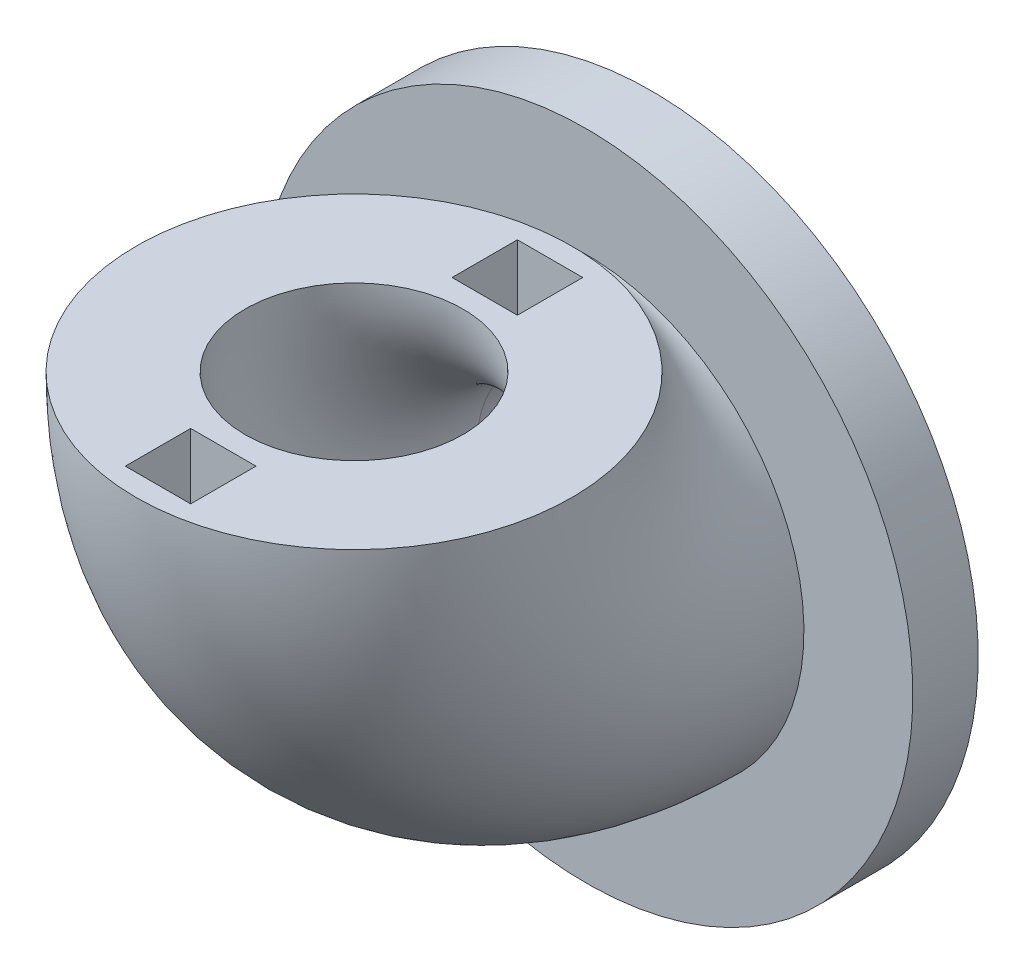
ISO-10303-21;
HEADER;
FILE_DESCRIPTION(('STEP AP214'),'2;1');
FILE_NAME('part.step','',(''),(''),'','','');
FILE_SCHEMA(('AUTOMOTIVE_DESIGN { 1 0 10303 214 1 1 1 1 }'));
ENDSEC;
DATA;
#1=APPLICATION_CONTEXT('core data for automotive mechanical design processes');
#2=APPLICATION_PROTOCOL_DEFINITION('international standard','automotive_design',2000,#1);
#3=PRODUCT_CONTEXT('',#1,'mechanical');
#4=PRODUCT('Part','Part','',(#3));
#5=PRODUCT_RELATED_PRODUCT_CATEGORY('part','',(#4));
#6=PRODUCT_DEFINITION_FORMATION('','',#4);
#7=PRODUCT_DEFINITION_CONTEXT('part definition',#1,'design');
#8=PRODUCT_DEFINITION('design','',#6,#7);
#9=PRODUCT_DEFINITION_SHAPE('','',#8);
#10=(LENGTH_UNIT() NAMED_UNIT(*) SI_UNIT(.MILLI.,.METRE.));
#11=(NAMED_UNIT(*) PLANE_ANGLE_UNIT() SI_UNIT($,.RADIAN.));
#12=(NAMED_UNIT(*) SI_UNIT($,.STERADIAN.) SOLID_ANGLE_UNIT());
#13=UNCERTAINTY_MEASURE_WITH_UNIT(LENGTH_MEASURE(1.E-05),#10,'distance_accuracy_value','');
#14=(GEOMETRIC_REPRESENTATION_CONTEXT(3) GLOBAL_UNCERTAINTY_ASSIGNED_CONTEXT((#13)) GLOBAL_UNIT_ASSIGNED_CONTEXT((#10,
#11,#12)) REPRESENTATION_CONTEXT('',''));
#15=CARTESIAN_POINT('',(0.,0.,0.));
#16=DIRECTION('',(0.,0.,1.));
#17=DIRECTION('',(1.,0.,0.));
#18=AXIS2_PLACEMENT_3D('',#15,#16,#17);
#19=CARTESIAN_POINT('',(0.,10.6543954886718,0.));
#20=DIRECTION('',(-1.,0.,0.));
#21=DIRECTION('',(0.,0.,1.));
#22=AXIS2_PLACEMENT_3D('',#19,#20,#21);
#23=TOROIDAL_SURFACE('',#22,10.6543954886718,10.);
#24=CARTESIAN_POINT('',(0.,0.,0.));
#25=DIRECTION('',(0.,0.,1.));
#26=DIRECTION('',(1.,0.,0.));
#27=AXIS2_PLACEMENT_3D('',#24,#25,#26);
#28=CIRCLE('',#27,10.);
#29=CARTESIAN_POINT('',(0.,-10.,0.));
#30=VERTEX_POINT('',#29);
#31=EDGE_CURVE('E42',#30,#30,#28,.T.);
#32=CARTESIAN_POINT('',(0.,10.6543954886718,10.6543954886718));
#33=DIRECTION('',(0.,1.,0.));
#34=DIRECTION('',(1.,0.,0.));
#35=AXIS2_PLACEMENT_3D('',#32,#33,#34);
#36=CIRCLE('',#35,10.);
#37=CARTESIAN_POINT('',(0.,10.6543954886718,20.6543954886718));
#38=VERTEX_POINT('',#37);
#39=EDGE_CURVE('E48',#38,#38,#36,.T.);
#40=CARTESIAN_POINT('',(0.,10.6543954886718,0.));
#41=DIRECTION('',(-1.,0.,0.));
#42=DIRECTION('',(0.,0.,1.));
#43=AXIS2_PLACEMENT_3D('',#40,#41,#42);
#44=CIRCLE('',#43,20.6543954886718);
#45=EDGE_CURVE('',#30,#38,#44,.T.);
#46=ORIENTED_EDGE('',*,*,#31,.T.);
#47=ORIENTED_EDGE('',*,*,#39,.F.);
#48=ORIENTED_EDGE('',*,*,#45,.T.);
#49=ORIENTED_EDGE('',*,*,#45,.F.);
#50=EDGE_LOOP('',(#46,#48,#47,#49));
#51=FACE_BOUND('',#50,.T.);
#52=ADVANCED_FACE('F39',(#51),#23,.T.);
#53=CARTESIAN_POINT('',(0.,10.6543954886718,10.6543954886718));
#54=DIRECTION('',(0.,1.,0.));
#55=DIRECTION('',(1.,0.,0.));
#56=AXIS2_PLACEMENT_3D('',#53,#54,#55);
#57=PLANE('',#56);
#58=DIRECTION('',(0.,0.,-1.));
#59=VECTOR('',#58,1.);
#60=CARTESIAN_POINT('',(1.5,10.6543954886718,1.65439548867175));
#61=LINE('',#60,#59);
#62=CARTESIAN_POINT('',(1.5,10.6543954886718,4.65439548867175));
#63=VERTEX_POINT('',#62);
#64=CARTESIAN_POINT('',(1.5,10.6543954886718,1.65439548867175));
#65=VERTEX_POINT('',#64);
#66=EDGE_CURVE('E56',#63,#65,#61,.T.);
#67=ORIENTED_EDGE('',*,*,#66,.F.);
#68=DIRECTION('',(1.,0.,0.));
#69=VECTOR('',#68,1.);
#70=CARTESIAN_POINT('',(-1.5,10.6543954886718,4.65439548867175));
#71=LINE('',#70,#69);
#72=CARTESIAN_POINT('',(-1.5,10.6543954886718,4.65439548867175));
#73=VERTEX_POINT('',#72);
#74=EDGE_CURVE('E129',#73,#63,#71,.T.);
#75=ORIENTED_EDGE('',*,*,#74,.F.);
#76=DIRECTION('',(0.,0.,1.));
#77=VECTOR('',#76,1.);
#78=CARTESIAN_POINT('',(-1.5,10.6543954886718,1.65439548867175));
#79=LINE('',#78,#77);
#80=CARTESIAN_POINT('',(-1.5,10.6543954886718,1.65439548867175));
#81=VERTEX_POINT('',#80);
#82=EDGE_CURVE('E133',#81,#73,#79,.T.);
#83=ORIENTED_EDGE('',*,*,#82,.F.);
#84=DIRECTION('',(-1.,0.,0.));
#85=VECTOR('',#84,1.);
#86=CARTESIAN_POINT('',(-1.5,10.6543954886718,1.65439548867175));
#87=LINE('',#86,#85);
#88=EDGE_CURVE('E142',#65,#81,#87,.T.);
#89=ORIENTED_EDGE('',*,*,#88,.F.);
#90=EDGE_LOOP('',(#67,#75,#83,#89));
#91=FACE_BOUND('',#90,.T.);
#92=DIRECTION('',(0.,0.,1.));
#93=VECTOR('',#92,1.);
#94=CARTESIAN_POINT('',(-1.5,10.6543954886718,19.6543954886718));
#95=LINE('',#94,#93);
#96=CARTESIAN_POINT('',(-1.5,10.6543954886718,16.6543954886718));
#97=VERTEX_POINT('',#96);
#98=CARTESIAN_POINT('',(-1.5,10.6543954886718,19.6543954886718));
#99=VERTEX_POINT('',#98);
#100=EDGE_CURVE('E64',#97,#99,#95,.T.);
#101=ORIENTED_EDGE('',*,*,#100,.F.);
#102=DIRECTION('',(-1.,0.,0.));
#103=VECTOR('',#102,1.);
#104=CARTESIAN_POINT('',(-1.5,10.6543954886718,16.6543954886718));
#105=LINE('',#104,#103);
#106=CARTESIAN_POINT('',(1.5,10.6543954886718,16.6543954886718));
#107=VERTEX_POINT('',#106);
#108=EDGE_CURVE('E163',#107,#97,#105,.T.);
#109=ORIENTED_EDGE('',*,*,#108,.F.);
#110=DIRECTION('',(0.,0.,-1.));
#111=VECTOR('',#110,1.);
#112=CARTESIAN_POINT('',(1.5,10.6543954886718,19.6543954886718));
#113=LINE('',#112,#111);
#114=CARTESIAN_POINT('',(1.5,10.6543954886718,19.6543954886718));
#115=VERTEX_POINT('',#114);
#116=EDGE_CURVE('E182',#115,#107,#113,.T.);
#117=ORIENTED_EDGE('',*,*,#116,.F.);
#118=DIRECTION('',(1.,0.,0.));
#119=VECTOR('',#118,1.);
#120=CARTESIAN_POINT('',(-1.5,10.6543954886718,19.6543954886718));
#121=LINE('',#120,#119);
#122=EDGE_CURVE('E178',#99,#115,#121,.T.);
#123=ORIENTED_EDGE('',*,*,#122,.F.);
#124=EDGE_LOOP('',(#101,#109,#117,#123));
#125=FACE_BOUND('',#124,.T.);
#126=CARTESIAN_POINT('',(0.,10.6543954886718,10.6543954886718));
#127=DIRECTION('',(0.,1.,0.));
#128=DIRECTION('',(1.,0.,0.));
#129=AXIS2_PLACEMENT_3D('',#126,#127,#128);
#130=CIRCLE('',#129,5.);
#131=CARTESIAN_POINT('',(0.,10.6543954886718,15.6543954886718));
#132=VERTEX_POINT('',#131);
#133=EDGE_CURVE('E11',#132,#132,#130,.F.);
#134=ORIENTED_EDGE('',*,*,#133,.T.);
#135=EDGE_LOOP('',(#134));
#136=FACE_BOUND('',#135,.T.);
#137=ORIENTED_EDGE('',*,*,#39,.T.);
#138=EDGE_LOOP('',(#137));
#139=FACE_BOUND('',#138,.T.);
#140=ADVANCED_FACE('F244',(#91,#125,#136,#139),#57,.T.);
#141=CARTESIAN_POINT('',(0.,10.6543954886718,0.));
#142=DIRECTION('',(-1.,0.,0.));
#143=DIRECTION('',(0.,0.,1.));
#144=AXIS2_PLACEMENT_3D('',#141,#142,#143);
#145=TOROIDAL_SURFACE('',#144,10.6543954886718,5.);
#146=CARTESIAN_POINT('',(0.,0.,0.));
#147=DIRECTION('',(0.,0.,-1.));
#148=DIRECTION('',(-1.,0.,0.));
#149=AXIS2_PLACEMENT_3D('',#146,#147,#148);
#150=CIRCLE('',#149,5.);
#151=CARTESIAN_POINT('',(0.,-5.,0.));
#152=VERTEX_POINT('',#151);
#153=EDGE_CURVE('E152',#152,#152,#150,.T.);
#154=CARTESIAN_POINT('',(0.,10.6543954886718,0.));
#155=DIRECTION('',(-1.,0.,0.));
#156=DIRECTION('',(0.,0.,1.));
#157=AXIS2_PLACEMENT_3D('',#154,#155,#156);
#158=CIRCLE('',#157,15.6543954886718);
#159=EDGE_CURVE('',#152,#132,#158,.T.);
#160=ORIENTED_EDGE('',*,*,#153,.T.);
#161=ORIENTED_EDGE('',*,*,#133,.F.);
#162=ORIENTED_EDGE('',*,*,#159,.T.);
#163=ORIENTED_EDGE('',*,*,#159,.F.);
#164=EDGE_LOOP('',(#160,#162,#161,#163));
#165=FACE_BOUND('',#164,.T.);
#166=ADVANCED_FACE('F242',(#165),#145,.F.);
#167=CARTESIAN_POINT('',(0.,0.,-3.));
#168=DIRECTION('',(0.,0.,-1.));
#169=DIRECTION('',(-1.,0.,0.));
#170=AXIS2_PLACEMENT_3D('',#167,#168,#169);
#171=PLANE('',#170);
#172=CARTESIAN_POINT('',(0.,0.,-3.));
#173=DIRECTION('',(0.,0.,-1.));
#174=DIRECTION('',(-1.,0.,0.));
#175=AXIS2_PLACEMENT_3D('',#172,#173,#174);
#176=CIRCLE('',#175,15.);
#177=CARTESIAN_POINT('',(-15.,0.,-3.));
#178=VERTEX_POINT('',#177);
#179=EDGE_CURVE('E207',#178,#178,#176,.T.);
#180=ORIENTED_EDGE('',*,*,#179,.T.);
#181=EDGE_LOOP('',(#180));
#182=FACE_BOUND('',#181,.T.);
#183=CARTESIAN_POINT('',(0.,0.,-3.));
#184=DIRECTION('',(0.,0.,-1.));
#185=DIRECTION('',(-1.,0.,0.));
#186=AXIS2_PLACEMENT_3D('',#183,#184,#185);
#187=CIRCLE('',#186,5.);
#188=CARTESIAN_POINT('',(-5.,0.,-3.));
#189=VERTEX_POINT('',#188);
#190=EDGE_CURVE('E199',#189,#189,#187,.T.);
#191=ORIENTED_EDGE('',*,*,#190,.F.);
#192=EDGE_LOOP('',(#191));
#193=FACE_BOUND('',#192,.T.);
#194=ADVANCED_FACE('F226',(#182,#193),#171,.T.);
#195=CARTESIAN_POINT('',(0.,0.,0.));
#196=DIRECTION('',(0.,0.,-1.));
#197=DIRECTION('',(-1.,0.,0.));
#198=AXIS2_PLACEMENT_3D('',#195,#196,#197);
#199=PLANE('',#198);
#200=ORIENTED_EDGE('',*,*,#31,.F.);
#201=EDGE_LOOP('',(#200));
#202=FACE_BOUND('',#201,.T.);
#203=CARTESIAN_POINT('',(0.,0.,0.));
#204=DIRECTION('',(0.,0.,-1.));
#205=DIRECTION('',(-1.,0.,0.));
#206=AXIS2_PLACEMENT_3D('',#203,#204,#205);
#207=CIRCLE('',#206,15.);
#208=CARTESIAN_POINT('',(-15.,0.,0.));
#209=VERTEX_POINT('',#208);
#210=EDGE_CURVE('E203',#209,#209,#207,.T.);
#211=ORIENTED_EDGE('',*,*,#210,.F.);
#212=EDGE_LOOP('',(#211));
#213=FACE_BOUND('',#212,.T.);
#214=ADVANCED_FACE('F222',(#202,#213),#199,.F.);
#215=CARTESIAN_POINT('',(0.,0.,-3.));
#216=DIRECTION('',(0.,0.,1.));
#217=DIRECTION('',(1.,0.,0.));
#218=AXIS2_PLACEMENT_3D('',#215,#216,#217);
#219=CYLINDRICAL_SURFACE('',#218,15.);
#220=ORIENTED_EDGE('',*,*,#179,.F.);
#221=EDGE_LOOP('',(#220));
#222=FACE_BOUND('',#221,.T.);
#223=ORIENTED_EDGE('',*,*,#210,.T.);
#224=EDGE_LOOP('',(#223));
#225=FACE_BOUND('',#224,.T.);
#226=ADVANCED_FACE('F225',(#222,#225),#219,.T.);
#227=CARTESIAN_POINT('',(0.,0.,-3.));
#228=DIRECTION('',(0.,0.,1.));
#229=DIRECTION('',(1.,0.,0.));
#230=AXIS2_PLACEMENT_3D('',#227,#228,#229);
#231=CYLINDRICAL_SURFACE('',#230,5.);
#232=ORIENTED_EDGE('',*,*,#190,.T.);
#233=EDGE_LOOP('',(#232));
#234=FACE_BOUND('',#233,.T.);
#235=ORIENTED_EDGE('',*,*,#153,.F.);
#236=EDGE_LOOP('',(#235));
#237=FACE_BOUND('',#236,.T.);
#238=ADVANCED_FACE('F231',(#234,#237),#231,.F.);
#239=CARTESIAN_POINT('',(-1.5,7.65439548867176,19.6543954886718));
#240=DIRECTION('',(-1.,0.,0.));
#241=DIRECTION('',(0.,0.,1.));
#242=AXIS2_PLACEMENT_3D('',#239,#240,#241);
#243=PLANE('',#242);
#244=ORIENTED_EDGE('',*,*,#100,.T.);
#245=DIRECTION('',(0.,1.,0.));
#246=VECTOR('',#245,1.);
#247=CARTESIAN_POINT('',(-1.5,7.65439548867176,19.6543954886718));
#248=LINE('',#247,#246);
#249=CARTESIAN_POINT('',(-1.5,7.65439548867176,19.6543954886718));
#250=VERTEX_POINT('',#249);
#251=EDGE_CURVE('E175',#250,#99,#248,.T.);
#252=ORIENTED_EDGE('',*,*,#251,.F.);
#253=DIRECTION('',(0.,0.,1.));
#254=VECTOR('',#253,1.);
#255=CARTESIAN_POINT('',(-1.5,7.65439548867176,19.6543954886718));
#256=LINE('',#255,#254);
#257=CARTESIAN_POINT('',(-1.5,7.65439548867176,16.6543954886718));
#258=VERTEX_POINT('',#257);
#259=EDGE_CURVE('E158',#258,#250,#256,.T.);
#260=ORIENTED_EDGE('',*,*,#259,.F.);
#261=DIRECTION('',(0.,1.,0.));
#262=VECTOR('',#261,1.);
#263=CARTESIAN_POINT('',(-1.5,7.65439548867176,16.6543954886718));
#264=LINE('',#263,#262);
#265=EDGE_CURVE('E143',#258,#97,#264,.T.);
#266=ORIENTED_EDGE('',*,*,#265,.T.);
#267=EDGE_LOOP('',(#244,#252,#260,#266));
#268=FACE_BOUND('',#267,.T.);
#269=ADVANCED_FACE('F237',(#268),#243,.F.);
#270=CARTESIAN_POINT('',(-1.5,7.65439548867176,16.6543954886718));
#271=DIRECTION('',(0.,0.,-1.));
#272=DIRECTION('',(0.,1.,0.));
#273=AXIS2_PLACEMENT_3D('',#270,#271,#272);
#274=PLANE('',#273);
#275=ORIENTED_EDGE('',*,*,#108,.T.);
#276=ORIENTED_EDGE('',*,*,#265,.F.);
#277=DIRECTION('',(-1.,0.,0.));
#278=VECTOR('',#277,1.);
#279=CARTESIAN_POINT('',(-1.5,7.65439548867176,16.6543954886718));
#280=LINE('',#279,#278);
#281=CARTESIAN_POINT('',(1.5,7.65439548867176,16.6543954886718));
#282=VERTEX_POINT('',#281);
#283=EDGE_CURVE('E171',#282,#258,#280,.T.);
#284=ORIENTED_EDGE('',*,*,#283,.F.);
#285=DIRECTION('',(0.,1.,0.));
#286=VECTOR('',#285,1.);
#287=CARTESIAN_POINT('',(1.5,7.65439548867176,16.6543954886718));
#288=LINE('',#287,#286);
#289=EDGE_CURVE('E191',#282,#107,#288,.T.);
#290=ORIENTED_EDGE('',*,*,#289,.T.);
#291=EDGE_LOOP('',(#275,#276,#284,#290));
#292=FACE_BOUND('',#291,.T.);
#293=ADVANCED_FACE('F276',(#292),#274,.F.);
#294=CARTESIAN_POINT('',(1.5,7.65439548867176,19.6543954886718));
#295=DIRECTION('',(1.,0.,0.));
#296=DIRECTION('',(0.,0.,-1.));
#297=AXIS2_PLACEMENT_3D('',#294,#295,#296);
#298=PLANE('',#297);
#299=ORIENTED_EDGE('',*,*,#116,.T.);
#300=ORIENTED_EDGE('',*,*,#289,.F.);
#301=DIRECTION('',(0.,0.,-1.));
#302=VECTOR('',#301,1.);
#303=CARTESIAN_POINT('',(1.5,7.65439548867176,19.6543954886718));
#304=LINE('',#303,#302);
#305=CARTESIAN_POINT('',(1.5,7.65439548867176,19.6543954886718));
#306=VERTEX_POINT('',#305);
#307=EDGE_CURVE('E167',#306,#282,#304,.T.);
#308=ORIENTED_EDGE('',*,*,#307,.F.);
#309=DIRECTION('',(0.,1.,0.));
#310=VECTOR('',#309,1.);
#311=CARTESIAN_POINT('',(1.5,7.65439548867176,19.6543954886718));
#312=LINE('',#311,#310);
#313=EDGE_CURVE('E194',#306,#115,#312,.T.);
#314=ORIENTED_EDGE('',*,*,#313,.T.);
#315=EDGE_LOOP('',(#299,#300,#308,#314));
#316=FACE_BOUND('',#315,.T.);
#317=ADVANCED_FACE('F278',(#316),#298,.F.);
#318=CARTESIAN_POINT('',(-1.5,7.65439548867176,19.6543954886718));
#319=DIRECTION('',(0.,0.,1.));
#320=DIRECTION('',(0.,-1.,0.));
#321=AXIS2_PLACEMENT_3D('',#318,#319,#320);
#322=PLANE('',#321);
#323=ORIENTED_EDGE('',*,*,#122,.T.);
#324=ORIENTED_EDGE('',*,*,#313,.F.);
#325=DIRECTION('',(1.,0.,0.));
#326=VECTOR('',#325,1.);
#327=CARTESIAN_POINT('',(-1.5,7.65439548867176,19.6543954886718));
#328=LINE('',#327,#326);
#329=EDGE_CURVE('E162',#250,#306,#328,.T.);
#330=ORIENTED_EDGE('',*,*,#329,.F.);
#331=ORIENTED_EDGE('',*,*,#251,.T.);
#332=EDGE_LOOP('',(#323,#324,#330,#331));
#333=FACE_BOUND('',#332,.T.);
#334=ADVANCED_FACE('F268',(#333),#322,.F.);
#335=CARTESIAN_POINT('',(0.,7.65439548867176,0.));
#336=DIRECTION('',(0.,-1.,0.));
#337=DIRECTION('',(0.,0.,-1.));
#338=AXIS2_PLACEMENT_3D('',#335,#336,#337);
#339=PLANE('',#338);
#340=ORIENTED_EDGE('',*,*,#259,.T.);
#341=ORIENTED_EDGE('',*,*,#329,.T.);
#342=ORIENTED_EDGE('',*,*,#307,.T.);
#343=ORIENTED_EDGE('',*,*,#283,.T.);
#344=EDGE_LOOP('',(#340,#341,#342,#343));
#345=FACE_BOUND('',#344,.T.);
#346=ADVANCED_FACE('F274',(#345),#339,.F.);
#347=CARTESIAN_POINT('',(1.5,7.65439548867175,1.65439548867175));
#348=DIRECTION('',(1.,0.,0.));
#349=DIRECTION('',(0.,0.,-1.));
#350=AXIS2_PLACEMENT_3D('',#347,#348,#349);
#351=PLANE('',#350);
#352=ORIENTED_EDGE('',*,*,#66,.T.);
#353=DIRECTION('',(0.,1.,0.));
#354=VECTOR('',#353,1.);
#355=CARTESIAN_POINT('',(1.5,7.65439548867175,1.65439548867175));
#356=LINE('',#355,#354);
#357=CARTESIAN_POINT('',(1.5,7.65439548867175,1.65439548867175));
#358=VERTEX_POINT('',#357);
#359=EDGE_CURVE('E104',#358,#65,#356,.T.);
#360=ORIENTED_EDGE('',*,*,#359,.F.);
#361=DIRECTION('',(0.,0.,-1.));
#362=VECTOR('',#361,1.);
#363=CARTESIAN_POINT('',(1.5,7.65439548867175,1.65439548867175));
#364=LINE('',#363,#362);
#365=CARTESIAN_POINT('',(1.5,7.65439548867175,4.65439548867175));
#366=VERTEX_POINT('',#365);
#367=EDGE_CURVE('E108',#366,#358,#364,.T.);
#368=ORIENTED_EDGE('',*,*,#367,.F.);
#369=DIRECTION('',(0.,1.,0.));
#370=VECTOR('',#369,1.);
#371=CARTESIAN_POINT('',(1.5,7.65439548867175,4.65439548867175));
#372=LINE('',#371,#370);
#373=EDGE_CURVE('E149',#366,#63,#372,.T.);
#374=ORIENTED_EDGE('',*,*,#373,.T.);
#375=EDGE_LOOP('',(#352,#360,#368,#374));
#376=FACE_BOUND('',#375,.T.);
#377=ADVANCED_FACE('F106',(#376),#351,.F.);
#378=CARTESIAN_POINT('',(-1.5,7.65439548867175,4.65439548867175));
#379=DIRECTION('',(0.,0.,1.));
#380=DIRECTION('',(0.,-1.,0.));
#381=AXIS2_PLACEMENT_3D('',#378,#379,#380);
#382=PLANE('',#381);
#383=ORIENTED_EDGE('',*,*,#74,.T.);
#384=ORIENTED_EDGE('',*,*,#373,.F.);
#385=DIRECTION('',(1.,0.,0.));
#386=VECTOR('',#385,1.);
#387=CARTESIAN_POINT('',(-1.5,7.65439548867175,4.65439548867175));
#388=LINE('',#387,#386);
#389=CARTESIAN_POINT('',(-1.5,7.65439548867175,4.65439548867175));
#390=VERTEX_POINT('',#389);
#391=EDGE_CURVE('E115',#390,#366,#388,.T.);
#392=ORIENTED_EDGE('',*,*,#391,.F.);
#393=DIRECTION('',(0.,1.,0.));
#394=VECTOR('',#393,1.);
#395=CARTESIAN_POINT('',(-1.5,7.65439548867175,4.65439548867175));
#396=LINE('',#395,#394);
#397=EDGE_CURVE('E153',#390,#73,#396,.T.);
#398=ORIENTED_EDGE('',*,*,#397,.T.);
#399=EDGE_LOOP('',(#383,#384,#392,#398));
#400=FACE_BOUND('',#399,.T.);
#401=ADVANCED_FACE('F324',(#400),#382,.F.);
#402=CARTESIAN_POINT('',(-1.5,7.65439548867175,1.65439548867175));
#403=DIRECTION('',(-1.,0.,0.));
#404=DIRECTION('',(0.,0.,1.));
#405=AXIS2_PLACEMENT_3D('',#402,#403,#404);
#406=PLANE('',#405);
#407=ORIENTED_EDGE('',*,*,#82,.T.);
#408=ORIENTED_EDGE('',*,*,#397,.F.);
#409=DIRECTION('',(0.,0.,1.));
#410=VECTOR('',#409,1.);
#411=CARTESIAN_POINT('',(-1.5,7.65439548867175,1.65439548867175));
#412=LINE('',#411,#410);
#413=CARTESIAN_POINT('',(-1.5,7.65439548867175,1.65439548867175));
#414=VERTEX_POINT('',#413);
#415=EDGE_CURVE('E124',#414,#390,#412,.T.);
#416=ORIENTED_EDGE('',*,*,#415,.F.);
#417=DIRECTION('',(0.,1.,0.));
#418=VECTOR('',#417,1.);
#419=CARTESIAN_POINT('',(-1.5,7.65439548867175,1.65439548867175));
#420=LINE('',#419,#418);
#421=EDGE_CURVE('E114',#414,#81,#420,.T.);
#422=ORIENTED_EDGE('',*,*,#421,.T.);
#423=EDGE_LOOP('',(#407,#408,#416,#422));
#424=FACE_BOUND('',#423,.T.);
#425=ADVANCED_FACE('F333',(#424),#406,.F.);
#426=CARTESIAN_POINT('',(-1.5,7.65439548867175,1.65439548867175));
#427=DIRECTION('',(0.,0.,-1.));
#428=DIRECTION('',(0.,1.,0.));
#429=AXIS2_PLACEMENT_3D('',#426,#427,#428);
#430=PLANE('',#429);
#431=ORIENTED_EDGE('',*,*,#88,.T.);
#432=ORIENTED_EDGE('',*,*,#421,.F.);
#433=DIRECTION('',(-1.,0.,0.));
#434=VECTOR('',#433,1.);
#435=CARTESIAN_POINT('',(-1.5,7.65439548867175,1.65439548867175));
#436=LINE('',#435,#434);
#437=EDGE_CURVE('E118',#358,#414,#436,.T.);
#438=ORIENTED_EDGE('',*,*,#437,.F.);
#439=ORIENTED_EDGE('',*,*,#359,.T.);
#440=EDGE_LOOP('',(#431,#432,#438,#439));
#441=FACE_BOUND('',#440,.T.);
#442=ADVANCED_FACE('F119',(#441),#430,.F.);
#443=CARTESIAN_POINT('',(0.,7.65439548867175,0.));
#444=DIRECTION('',(0.,1.,0.));
#445=DIRECTION('',(0.,0.,1.));
#446=AXIS2_PLACEMENT_3D('',#443,#444,#445);
#447=PLANE('',#446);
#448=ORIENTED_EDGE('',*,*,#367,.T.);
#449=ORIENTED_EDGE('',*,*,#437,.T.);
#450=ORIENTED_EDGE('',*,*,#415,.T.);
#451=ORIENTED_EDGE('',*,*,#391,.T.);
#452=EDGE_LOOP('',(#448,#449,#450,#451));
#453=FACE_BOUND('',#452,.T.);
#454=ADVANCED_FACE('F126',(#453),#447,.T.);
#455=CLOSED_SHELL('',(#52,#140,#166,#194,#214,#226,#238,#269,#293,#317,#334,#346,#377,#401,#425,
#442,#454));
#456=MANIFOLD_SOLID_BREP('B2',#455);
#457=ADVANCED_BREP_SHAPE_REPRESENTATION('',(#18,#456),#14);
#458=SHAPE_DEFINITION_REPRESENTATION(#9,#457);
ENDSEC;
END-ISO-10303-21;
